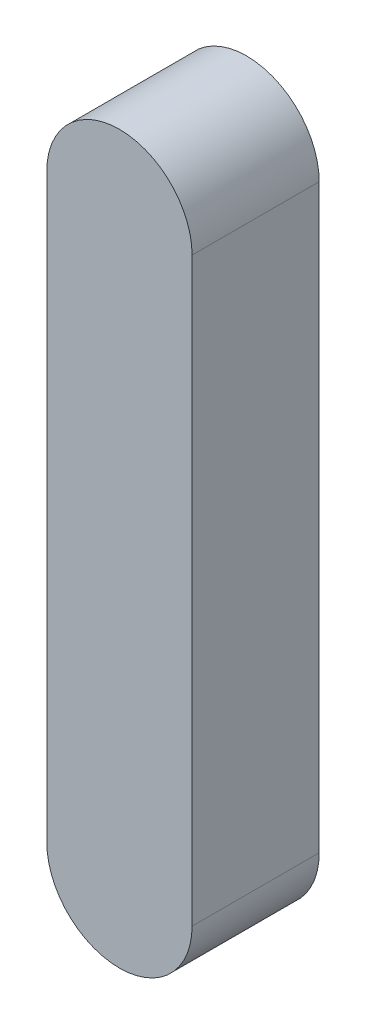
ISO-10303-21;
HEADER;
FILE_DESCRIPTION(('STEP AP214'),'2;1');
FILE_NAME('part.step','',(''),(''),'','','');
FILE_SCHEMA(('AUTOMOTIVE_DESIGN { 1 0 10303 214 1 1 1 1 }'));
ENDSEC;
DATA;
#1=APPLICATION_CONTEXT('core data for automotive mechanical design processes');
#2=APPLICATION_PROTOCOL_DEFINITION('international standard','automotive_design',2000,#1);
#3=PRODUCT_CONTEXT('',#1,'mechanical');
#4=PRODUCT('Part','Part','',(#3));
#5=PRODUCT_RELATED_PRODUCT_CATEGORY('part','',(#4));
#6=PRODUCT_DEFINITION_FORMATION('','',#4);
#7=PRODUCT_DEFINITION_CONTEXT('part definition',#1,'design');
#8=PRODUCT_DEFINITION('design','',#6,#7);
#9=PRODUCT_DEFINITION_SHAPE('','',#8);
#10=(LENGTH_UNIT() NAMED_UNIT(*) SI_UNIT(.MILLI.,.METRE.));
#11=(NAMED_UNIT(*) PLANE_ANGLE_UNIT() SI_UNIT($,.RADIAN.));
#12=(NAMED_UNIT(*) SI_UNIT($,.STERADIAN.) SOLID_ANGLE_UNIT());
#13=UNCERTAINTY_MEASURE_WITH_UNIT(LENGTH_MEASURE(1.E-05),#10,'distance_accuracy_value','');
#14=(GEOMETRIC_REPRESENTATION_CONTEXT(3) GLOBAL_UNCERTAINTY_ASSIGNED_CONTEXT((#13)) GLOBAL_UNIT_ASSIGNED_CONTEXT((#10,
#11,#12)) REPRESENTATION_CONTEXT('',''));
#15=CARTESIAN_POINT('',(0.,0.,0.));
#16=DIRECTION('',(0.,0.,1.));
#17=DIRECTION('',(1.,0.,0.));
#18=AXIS2_PLACEMENT_3D('',#15,#16,#17);
#19=CARTESIAN_POINT('',(-8.71355032920837,20.5277409553528,0.));
#20=DIRECTION('',(0.,0.,1.));
#21=DIRECTION('',(1.,0.,0.));
#22=AXIS2_PLACEMENT_3D('',#19,#20,#21);
#23=PLANE('',#22);
#24=CARTESIAN_POINT('',(-8.71355032920837,36.5277409553528,0.));
#25=DIRECTION('',(0.,0.,1.));
#26=DIRECTION('',(1.,0.,0.));
#27=AXIS2_PLACEMENT_3D('',#24,#25,#26);
#28=CIRCLE('',#27,4.);
#29=CARTESIAN_POINT('',(-4.71355032920837,36.5277409553528,0.));
#30=VERTEX_POINT('',#29);
#31=CARTESIAN_POINT('',(-12.7135503292084,36.5277409553528,0.));
#32=VERTEX_POINT('',#31);
#33=EDGE_CURVE('E19',#30,#32,#28,.T.);
#34=ORIENTED_EDGE('',*,*,#33,.F.);
#35=DIRECTION('',(0.,1.,0.));
#36=VECTOR('',#35,1.);
#37=CARTESIAN_POINT('',(-4.71355032920837,20.5277409553528,0.));
#38=LINE('',#37,#36);
#39=CARTESIAN_POINT('',(-4.71355032920837,4.52774095535278,0.));
#40=VERTEX_POINT('',#39);
#41=EDGE_CURVE('E58',#40,#30,#38,.T.);
#42=ORIENTED_EDGE('',*,*,#41,.F.);
#43=CARTESIAN_POINT('',(-8.71355032920837,4.52774095535278,0.));
#44=DIRECTION('',(0.,0.,1.));
#45=DIRECTION('',(1.,0.,0.));
#46=AXIS2_PLACEMENT_3D('',#43,#44,#45);
#47=CIRCLE('',#46,4.00000000000001);
#48=CARTESIAN_POINT('',(-12.7135503292084,4.52774095535278,0.));
#49=VERTEX_POINT('',#48);
#50=EDGE_CURVE('E72',#49,#40,#47,.T.);
#51=ORIENTED_EDGE('',*,*,#50,.F.);
#52=DIRECTION('',(0.,-1.,0.));
#53=VECTOR('',#52,1.);
#54=CARTESIAN_POINT('',(-12.7135503292084,20.5277409553528,0.));
#55=LINE('',#54,#53);
#56=EDGE_CURVE('E59',#32,#49,#55,.T.);
#57=ORIENTED_EDGE('',*,*,#56,.F.);
#58=EDGE_LOOP('',(#34,#42,#51,#57));
#59=FACE_BOUND('',#58,.T.);
#60=ADVANCED_FACE('F16',(#59),#23,.F.);
#61=CARTESIAN_POINT('',(-8.71355032920837,36.5277409553528,0.));
#62=DIRECTION('',(0.,0.,1.));
#63=DIRECTION('',(1.,0.,0.));
#64=AXIS2_PLACEMENT_3D('',#61,#62,#63);
#65=CYLINDRICAL_SURFACE('',#64,4.);
#66=ORIENTED_EDGE('',*,*,#33,.T.);
#67=DIRECTION('',(0.,0.,1.));
#68=VECTOR('',#67,1.);
#69=CARTESIAN_POINT('',(-12.7135503292084,36.5277409553528,0.));
#70=LINE('',#69,#68);
#71=CARTESIAN_POINT('',(-12.7135503292084,36.5277409553528,7.));
#72=VERTEX_POINT('',#71);
#73=EDGE_CURVE('E62',#72,#32,#70,.F.);
#74=ORIENTED_EDGE('',*,*,#73,.F.);
#75=CARTESIAN_POINT('',(-8.71355032920837,36.5277409553528,7.));
#76=DIRECTION('',(0.,0.,1.));
#77=DIRECTION('',(1.,0.,0.));
#78=AXIS2_PLACEMENT_3D('',#75,#76,#77);
#79=CIRCLE('',#78,4.);
#80=CARTESIAN_POINT('',(-4.71355032920837,36.5277409553528,7.));
#81=VERTEX_POINT('',#80);
#82=EDGE_CURVE('E67',#81,#72,#79,.T.);
#83=ORIENTED_EDGE('',*,*,#82,.F.);
#84=DIRECTION('',(0.,0.,1.));
#85=VECTOR('',#84,1.);
#86=CARTESIAN_POINT('',(-4.71355032920837,36.5277409553528,0.));
#87=LINE('',#86,#85);
#88=EDGE_CURVE('E64',#30,#81,#87,.T.);
#89=ORIENTED_EDGE('',*,*,#88,.F.);
#90=EDGE_LOOP('',(#66,#74,#83,#89));
#91=FACE_BOUND('',#90,.T.);
#92=ADVANCED_FACE('F65',(#91),#65,.T.);
#93=CARTESIAN_POINT('',(-12.7135503292084,20.5277409553528,0.));
#94=DIRECTION('',(-1.,0.,0.));
#95=DIRECTION('',(0.,-1.,0.));
#96=AXIS2_PLACEMENT_3D('',#93,#94,#95);
#97=PLANE('',#96);
#98=ORIENTED_EDGE('',*,*,#56,.T.);
#99=DIRECTION('',(0.,0.,1.));
#100=VECTOR('',#99,1.);
#101=CARTESIAN_POINT('',(-12.7135503292084,4.52774095535278,0.));
#102=LINE('',#101,#100);
#103=CARTESIAN_POINT('',(-12.7135503292084,4.52774095535278,7.));
#104=VERTEX_POINT('',#103);
#105=EDGE_CURVE('E78',#104,#49,#102,.F.);
#106=ORIENTED_EDGE('',*,*,#105,.F.);
#107=DIRECTION('',(0.,1.,0.));
#108=VECTOR('',#107,1.);
#109=CARTESIAN_POINT('',(-12.7135503292084,20.5277409553528,7.));
#110=LINE('',#109,#108);
#111=EDGE_CURVE('E81',#72,#104,#110,.F.);
#112=ORIENTED_EDGE('',*,*,#111,.F.);
#113=ORIENTED_EDGE('',*,*,#73,.T.);
#114=EDGE_LOOP('',(#98,#106,#112,#113));
#115=FACE_BOUND('',#114,.T.);
#116=ADVANCED_FACE('F89',(#115),#97,.T.);
#117=CARTESIAN_POINT('',(-8.71355032920837,4.52774095535278,0.));
#118=DIRECTION('',(0.,0.,1.));
#119=DIRECTION('',(1.,0.,0.));
#120=AXIS2_PLACEMENT_3D('',#117,#118,#119);
#121=CYLINDRICAL_SURFACE('',#120,4.00000000000001);
#122=ORIENTED_EDGE('',*,*,#50,.T.);
#123=DIRECTION('',(0.,0.,1.));
#124=VECTOR('',#123,1.);
#125=CARTESIAN_POINT('',(-4.71355032920837,4.52774095535278,0.));
#126=LINE('',#125,#124);
#127=CARTESIAN_POINT('',(-4.71355032920836,4.52774095535278,7.));
#128=VERTEX_POINT('',#127);
#129=EDGE_CURVE('E34',#128,#40,#126,.F.);
#130=ORIENTED_EDGE('',*,*,#129,.F.);
#131=CARTESIAN_POINT('',(-8.71355032920837,4.52774095535278,7.));
#132=DIRECTION('',(0.,0.,1.));
#133=DIRECTION('',(1.,0.,0.));
#134=AXIS2_PLACEMENT_3D('',#131,#132,#133);
#135=CIRCLE('',#134,4.00000000000001);
#136=EDGE_CURVE('E25',#104,#128,#135,.T.);
#137=ORIENTED_EDGE('',*,*,#136,.F.);
#138=ORIENTED_EDGE('',*,*,#105,.T.);
#139=EDGE_LOOP('',(#122,#130,#137,#138));
#140=FACE_BOUND('',#139,.T.);
#141=ADVANCED_FACE('F90',(#140),#121,.T.);
#142=CARTESIAN_POINT('',(-4.71355032920837,20.5277409553528,0.));
#143=DIRECTION('',(1.,0.,0.));
#144=DIRECTION('',(0.,1.,0.));
#145=AXIS2_PLACEMENT_3D('',#142,#143,#144);
#146=PLANE('',#145);
#147=ORIENTED_EDGE('',*,*,#41,.T.);
#148=ORIENTED_EDGE('',*,*,#88,.T.);
#149=DIRECTION('',(0.,1.,0.));
#150=VECTOR('',#149,1.);
#151=CARTESIAN_POINT('',(-4.71355032920836,20.5277409553528,7.));
#152=LINE('',#151,#150);
#153=EDGE_CURVE('E10',#128,#81,#152,.T.);
#154=ORIENTED_EDGE('',*,*,#153,.F.);
#155=ORIENTED_EDGE('',*,*,#129,.T.);
#156=EDGE_LOOP('',(#147,#148,#154,#155));
#157=FACE_BOUND('',#156,.T.);
#158=ADVANCED_FACE('F70',(#157),#146,.T.);
#159=CARTESIAN_POINT('',(-8.71355032920837,20.5277409553528,7.));
#160=DIRECTION('',(0.,0.,1.));
#161=DIRECTION('',(1.,0.,0.));
#162=AXIS2_PLACEMENT_3D('',#159,#160,#161);
#163=PLANE('',#162);
#164=ORIENTED_EDGE('',*,*,#136,.T.);
#165=ORIENTED_EDGE('',*,*,#153,.T.);
#166=ORIENTED_EDGE('',*,*,#82,.T.);
#167=ORIENTED_EDGE('',*,*,#111,.T.);
#168=EDGE_LOOP('',(#164,#165,#166,#167));
#169=FACE_BOUND('',#168,.T.);
#170=ADVANCED_FACE('F87',(#169),#163,.T.);
#171=CLOSED_SHELL('',(#60,#92,#116,#141,#158,#170));
#172=MANIFOLD_SOLID_BREP('B1',#171);
#173=ADVANCED_BREP_SHAPE_REPRESENTATION('',(#18,#172),#14);
#174=SHAPE_DEFINITION_REPRESENTATION(#9,#173);
ENDSEC;
END-ISO-10303-21;
